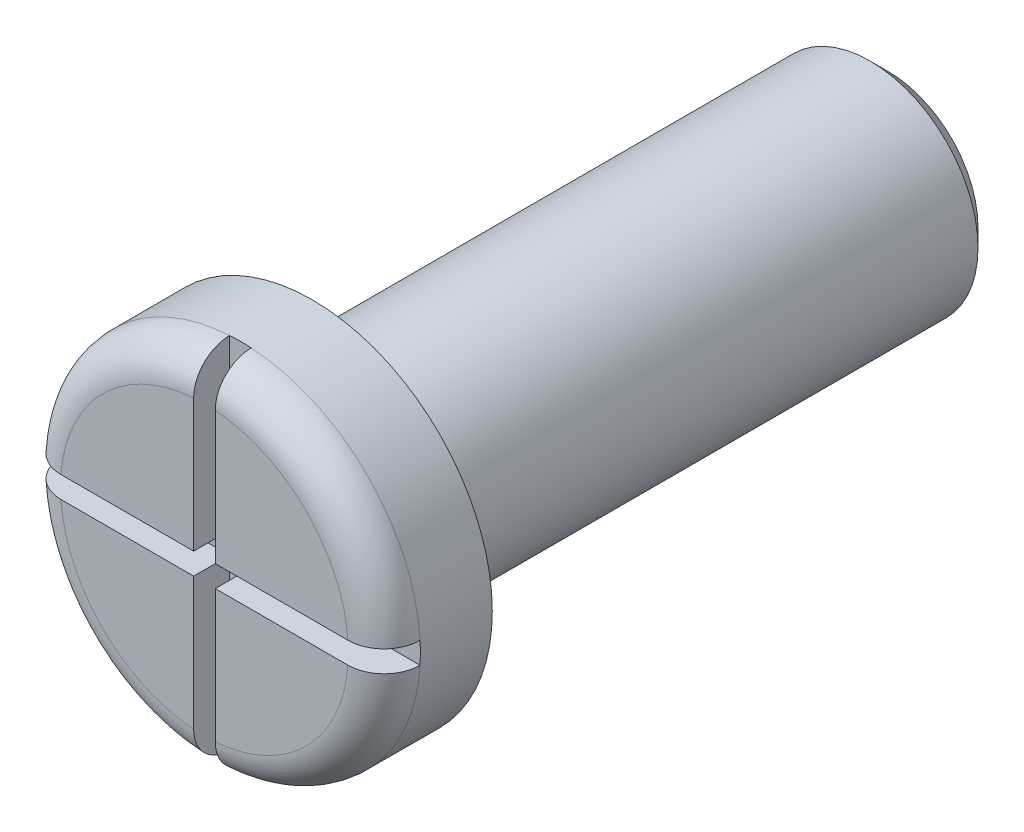
ISO-10303-21;
HEADER;
FILE_DESCRIPTION(('STEP AP214'),'2;1');
FILE_NAME('part.step','',(''),(''),'','','');
FILE_SCHEMA(('AUTOMOTIVE_DESIGN { 1 0 10303 214 1 1 1 1 }'));
ENDSEC;
DATA;
#1=APPLICATION_CONTEXT('core data for automotive mechanical design processes');
#2=APPLICATION_PROTOCOL_DEFINITION('international standard','automotive_design',2000,#1);
#3=PRODUCT_CONTEXT('',#1,'mechanical');
#4=PRODUCT('Part','Part','',(#3));
#5=PRODUCT_RELATED_PRODUCT_CATEGORY('part','',(#4));
#6=PRODUCT_DEFINITION_FORMATION('','',#4);
#7=PRODUCT_DEFINITION_CONTEXT('part definition',#1,'design');
#8=PRODUCT_DEFINITION('design','',#6,#7);
#9=PRODUCT_DEFINITION_SHAPE('','',#8);
#10=(LENGTH_UNIT() NAMED_UNIT(*) SI_UNIT(.MILLI.,.METRE.));
#11=(NAMED_UNIT(*) PLANE_ANGLE_UNIT() SI_UNIT($,.RADIAN.));
#12=(NAMED_UNIT(*) SI_UNIT($,.STERADIAN.) SOLID_ANGLE_UNIT());
#13=UNCERTAINTY_MEASURE_WITH_UNIT(LENGTH_MEASURE(1.E-05),#10,'distance_accuracy_value','');
#14=(GEOMETRIC_REPRESENTATION_CONTEXT(3) GLOBAL_UNCERTAINTY_ASSIGNED_CONTEXT((#13)) GLOBAL_UNIT_ASSIGNED_CONTEXT((#10,
#11,#12)) REPRESENTATION_CONTEXT('',''));
#15=CARTESIAN_POINT('',(0.,0.,0.));
#16=DIRECTION('',(0.,0.,1.));
#17=DIRECTION('',(1.,0.,0.));
#18=AXIS2_PLACEMENT_3D('',#15,#16,#17);
#19=CARTESIAN_POINT('',(0.,0.,0.));
#20=DIRECTION('',(0.,0.,1.));
#21=DIRECTION('',(1.,0.,0.));
#22=AXIS2_PLACEMENT_3D('',#19,#20,#21);
#23=CYLINDRICAL_SURFACE('',#22,2.5);
#24=CARTESIAN_POINT('',(0.,0.,-1.5));
#25=DIRECTION('',(0.,0.,1.));
#26=DIRECTION('',(1.,0.,0.));
#27=AXIS2_PLACEMENT_3D('',#24,#25,#26);
#28=CIRCLE('',#27,2.5);
#29=CARTESIAN_POINT('',(2.5,0.,-1.5));
#30=VERTEX_POINT('',#29);
#31=EDGE_CURVE('E230',#30,#30,#28,.T.);
#32=ORIENTED_EDGE('',*,*,#31,.T.);
#33=EDGE_LOOP('',(#32));
#34=FACE_BOUND('',#33,.T.);
#35=CARTESIAN_POINT('',(0.,0.,-0.5));
#36=DIRECTION('',(0.,0.,1.));
#37=DIRECTION('',(1.,0.,0.));
#38=AXIS2_PLACEMENT_3D('',#35,#36,#37);
#39=CIRCLE('',#38,2.5);
#40=CARTESIAN_POINT('',(-0.149999999999999,-2.49549594269356,-0.5));
#41=VERTEX_POINT('',#40);
#42=CARTESIAN_POINT('',(0.149999999999999,-2.49549594269356,-0.5));
#43=VERTEX_POINT('',#42);
#44=EDGE_CURVE('E135',#41,#43,#39,.T.);
#45=ORIENTED_EDGE('',*,*,#44,.F.);
#46=CARTESIAN_POINT('',(0.,0.,-0.5));
#47=DIRECTION('',(0.,0.,-1.));
#48=DIRECTION('',(-1.,0.,0.));
#49=AXIS2_PLACEMENT_3D('',#46,#47,#48);
#50=CIRCLE('',#49,2.5);
#51=CARTESIAN_POINT('',(-2.49549594269356,-0.15,-0.5));
#52=VERTEX_POINT('',#51);
#53=EDGE_CURVE('E130',#41,#52,#50,.T.);
#54=ORIENTED_EDGE('',*,*,#53,.T.);
#55=CARTESIAN_POINT('',(0.,0.,-0.5));
#56=DIRECTION('',(0.,0.,1.));
#57=DIRECTION('',(1.,0.,0.));
#58=AXIS2_PLACEMENT_3D('',#55,#56,#57);
#59=CIRCLE('',#58,2.5);
#60=CARTESIAN_POINT('',(-2.49549594269356,0.15,-0.5));
#61=VERTEX_POINT('',#60);
#62=EDGE_CURVE('E133',#61,#52,#59,.T.);
#63=ORIENTED_EDGE('',*,*,#62,.F.);
#64=CARTESIAN_POINT('',(0.,0.,-0.5));
#65=DIRECTION('',(0.,0.,-1.));
#66=DIRECTION('',(-1.,0.,0.));
#67=AXIS2_PLACEMENT_3D('',#64,#65,#66);
#68=CIRCLE('',#67,2.5);
#69=CARTESIAN_POINT('',(-0.149999999999999,2.49549594269356,-0.5));
#70=VERTEX_POINT('',#69);
#71=EDGE_CURVE('E241',#61,#70,#68,.T.);
#72=ORIENTED_EDGE('',*,*,#71,.T.);
#73=CARTESIAN_POINT('',(0.,0.,-0.5));
#74=DIRECTION('',(0.,0.,1.));
#75=DIRECTION('',(1.,0.,0.));
#76=AXIS2_PLACEMENT_3D('',#73,#74,#75);
#77=CIRCLE('',#76,2.5);
#78=CARTESIAN_POINT('',(0.149999999999999,2.49549594269356,-0.5));
#79=VERTEX_POINT('',#78);
#80=EDGE_CURVE('E354',#79,#70,#77,.T.);
#81=ORIENTED_EDGE('',*,*,#80,.F.);
#82=CARTESIAN_POINT('',(0.,0.,-0.5));
#83=DIRECTION('',(0.,0.,-1.));
#84=DIRECTION('',(-1.,0.,0.));
#85=AXIS2_PLACEMENT_3D('',#82,#83,#84);
#86=CIRCLE('',#85,2.5);
#87=CARTESIAN_POINT('',(2.49549594269356,0.149999999999999,-0.5));
#88=VERTEX_POINT('',#87);
#89=EDGE_CURVE('E243',#79,#88,#86,.T.);
#90=ORIENTED_EDGE('',*,*,#89,.T.);
#91=CARTESIAN_POINT('',(0.,0.,-0.5));
#92=DIRECTION('',(0.,0.,1.));
#93=DIRECTION('',(1.,0.,0.));
#94=AXIS2_PLACEMENT_3D('',#91,#92,#93);
#95=CIRCLE('',#94,2.5);
#96=CARTESIAN_POINT('',(2.49549594269356,-0.15,-0.5));
#97=VERTEX_POINT('',#96);
#98=EDGE_CURVE('E248',#97,#88,#95,.T.);
#99=ORIENTED_EDGE('',*,*,#98,.F.);
#100=CARTESIAN_POINT('',(0.,0.,-0.5));
#101=DIRECTION('',(0.,0.,-1.));
#102=DIRECTION('',(-1.,0.,0.));
#103=AXIS2_PLACEMENT_3D('',#100,#101,#102);
#104=CIRCLE('',#103,2.5);
#105=EDGE_CURVE('E139',#97,#43,#104,.T.);
#106=ORIENTED_EDGE('',*,*,#105,.T.);
#107=EDGE_LOOP('',(#45,#54,#63,#72,#81,#90,#99,#106));
#108=FACE_BOUND('',#107,.T.);
#109=ADVANCED_FACE('F35',(#34,#108),#23,.T.);
#110=CARTESIAN_POINT('',(0.,2.5,0.));
#111=DIRECTION('',(0.,0.,-1.));
#112=DIRECTION('',(-1.,0.,0.));
#113=AXIS2_PLACEMENT_3D('',#110,#111,#112);
#114=PLANE('',#113);
#115=DIRECTION('',(0.,-1.,0.));
#116=VECTOR('',#115,1.);
#117=CARTESIAN_POINT('',(-0.149999999999999,2.49549594269356,0.));
#118=LINE('',#117,#116);
#119=CARTESIAN_POINT('',(-0.149999999999999,1.99436706751791,0.));
#120=VERTEX_POINT('',#119);
#121=CARTESIAN_POINT('',(-0.149999999999999,0.15,0.));
#122=VERTEX_POINT('',#121);
#123=EDGE_CURVE('E332',#120,#122,#118,.T.);
#124=ORIENTED_EDGE('',*,*,#123,.F.);
#125=CARTESIAN_POINT('',(0.,0.,0.));
#126=DIRECTION('',(0.,0.,-1.));
#127=DIRECTION('',(-1.,0.,0.));
#128=AXIS2_PLACEMENT_3D('',#125,#126,#127);
#129=CIRCLE('',#128,2.);
#130=CARTESIAN_POINT('',(-1.99436706751791,0.15,0.));
#131=VERTEX_POINT('',#130);
#132=EDGE_CURVE('E303',#120,#131,#129,.F.);
#133=ORIENTED_EDGE('',*,*,#132,.T.);
#134=DIRECTION('',(1.,0.,0.));
#135=VECTOR('',#134,1.);
#136=CARTESIAN_POINT('',(-2.49549594269356,0.15,0.));
#137=LINE('',#136,#135);
#138=EDGE_CURVE('E157',#131,#122,#137,.T.);
#139=ORIENTED_EDGE('',*,*,#138,.T.);
#140=EDGE_LOOP('',(#124,#133,#139));
#141=FACE_BOUND('',#140,.T.);
#142=ADVANCED_FACE('F192',(#141),#114,.F.);
#143=DIRECTION('',(1.,0.,0.));
#144=VECTOR('',#143,1.);
#145=CARTESIAN_POINT('',(0.149999999999999,0.15,0.));
#146=LINE('',#145,#144);
#147=CARTESIAN_POINT('',(0.149999999999999,0.15,0.));
#148=VERTEX_POINT('',#147);
#149=CARTESIAN_POINT('',(1.99436706751791,0.15,0.));
#150=VERTEX_POINT('',#149);
#151=EDGE_CURVE('E321',#148,#150,#146,.T.);
#152=ORIENTED_EDGE('',*,*,#151,.T.);
#153=CARTESIAN_POINT('',(0.,0.,0.));
#154=DIRECTION('',(0.,0.,-1.));
#155=DIRECTION('',(-1.,0.,0.));
#156=AXIS2_PLACEMENT_3D('',#153,#154,#155);
#157=CIRCLE('',#156,2.);
#158=CARTESIAN_POINT('',(0.149999999999999,1.99436706751791,0.));
#159=VERTEX_POINT('',#158);
#160=EDGE_CURVE('E266',#150,#159,#157,.F.);
#161=ORIENTED_EDGE('',*,*,#160,.T.);
#162=DIRECTION('',(0.,-1.,0.));
#163=VECTOR('',#162,1.);
#164=CARTESIAN_POINT('',(0.149999999999999,2.49549594269356,0.));
#165=LINE('',#164,#163);
#166=EDGE_CURVE('E325',#159,#148,#165,.T.);
#167=ORIENTED_EDGE('',*,*,#166,.T.);
#168=EDGE_LOOP('',(#152,#161,#167));
#169=FACE_BOUND('',#168,.T.);
#170=ADVANCED_FACE('F387',(#169),#114,.F.);
#171=DIRECTION('',(0.,-1.,0.));
#172=VECTOR('',#171,1.);
#173=CARTESIAN_POINT('',(0.149999999999999,-0.15,0.));
#174=LINE('',#173,#172);
#175=CARTESIAN_POINT('',(0.149999999999999,-0.15,0.));
#176=VERTEX_POINT('',#175);
#177=CARTESIAN_POINT('',(0.149999999999999,-1.99436706751791,0.));
#178=VERTEX_POINT('',#177);
#179=EDGE_CURVE('E322',#176,#178,#174,.T.);
#180=ORIENTED_EDGE('',*,*,#179,.T.);
#181=CARTESIAN_POINT('',(0.,0.,0.));
#182=DIRECTION('',(0.,0.,-1.));
#183=DIRECTION('',(-1.,0.,0.));
#184=AXIS2_PLACEMENT_3D('',#181,#182,#183);
#185=CIRCLE('',#184,2.);
#186=CARTESIAN_POINT('',(1.99436706751791,-0.15,0.));
#187=VERTEX_POINT('',#186);
#188=EDGE_CURVE('E163',#178,#187,#185,.F.);
#189=ORIENTED_EDGE('',*,*,#188,.T.);
#190=DIRECTION('',(1.,0.,0.));
#191=VECTOR('',#190,1.);
#192=CARTESIAN_POINT('',(0.149999999999999,-0.15,0.));
#193=LINE('',#192,#191);
#194=EDGE_CURVE('E319',#176,#187,#193,.T.);
#195=ORIENTED_EDGE('',*,*,#194,.F.);
#196=EDGE_LOOP('',(#180,#189,#195));
#197=FACE_BOUND('',#196,.T.);
#198=ADVANCED_FACE('F193',(#197),#114,.F.);
#199=CARTESIAN_POINT('',(0.,0.,-9.5));
#200=DIRECTION('',(0.,0.,1.));
#201=DIRECTION('',(1.,0.,0.));
#202=AXIS2_PLACEMENT_3D('',#199,#200,#201);
#203=PLANE('',#202);
#204=CARTESIAN_POINT('',(0.,0.,-9.5));
#205=DIRECTION('',(0.,0.,1.));
#206=DIRECTION('',(1.,0.,0.));
#207=AXIS2_PLACEMENT_3D('',#204,#205,#206);
#208=CIRCLE('',#207,1.25);
#209=CARTESIAN_POINT('',(1.25,0.,-9.5));
#210=VERTEX_POINT('',#209);
#211=EDGE_CURVE('E222',#210,#210,#208,.F.);
#212=ORIENTED_EDGE('',*,*,#211,.T.);
#213=EDGE_LOOP('',(#212));
#214=FACE_BOUND('',#213,.T.);
#215=ADVANCED_FACE('F203',(#214),#203,.F.);
#216=CARTESIAN_POINT('',(0.,0.,0.));
#217=DIRECTION('',(0.,0.,1.));
#218=DIRECTION('',(1.,0.,0.));
#219=AXIS2_PLACEMENT_3D('',#216,#217,#218);
#220=CYLINDRICAL_SURFACE('',#219,1.5);
#221=CARTESIAN_POINT('',(0.,0.,-9.25));
#222=DIRECTION('',(0.,0.,1.));
#223=DIRECTION('',(1.,0.,0.));
#224=AXIS2_PLACEMENT_3D('',#221,#222,#223);
#225=CIRCLE('',#224,1.5);
#226=CARTESIAN_POINT('',(1.5,0.,-9.25));
#227=VERTEX_POINT('',#226);
#228=EDGE_CURVE('E225',#227,#227,#225,.T.);
#229=ORIENTED_EDGE('',*,*,#228,.T.);
#230=EDGE_LOOP('',(#229));
#231=FACE_BOUND('',#230,.T.);
#232=CARTESIAN_POINT('',(0.,0.,-1.5));
#233=DIRECTION('',(0.,0.,1.));
#234=DIRECTION('',(1.,0.,0.));
#235=AXIS2_PLACEMENT_3D('',#232,#233,#234);
#236=CIRCLE('',#235,1.5);
#237=CARTESIAN_POINT('',(1.5,0.,-1.5));
#238=VERTEX_POINT('',#237);
#239=EDGE_CURVE('E226',#238,#238,#236,.T.);
#240=ORIENTED_EDGE('',*,*,#239,.F.);
#241=EDGE_LOOP('',(#240));
#242=FACE_BOUND('',#241,.T.);
#243=ADVANCED_FACE('F199',(#231,#242),#220,.T.);
#244=CARTESIAN_POINT('',(0.,1.5,-1.5));
#245=DIRECTION('',(0.,0.,1.));
#246=DIRECTION('',(1.,0.,0.));
#247=AXIS2_PLACEMENT_3D('',#244,#245,#246);
#248=PLANE('',#247);
#249=ORIENTED_EDGE('',*,*,#31,.F.);
#250=EDGE_LOOP('',(#249));
#251=FACE_BOUND('',#250,.T.);
#252=ORIENTED_EDGE('',*,*,#239,.T.);
#253=EDGE_LOOP('',(#252));
#254=FACE_BOUND('',#253,.T.);
#255=ADVANCED_FACE('F190',(#251,#254),#248,.F.);
#256=DIRECTION('',(1.,0.,0.));
#257=VECTOR('',#256,1.);
#258=CARTESIAN_POINT('',(-2.49549594269356,-0.15,0.));
#259=LINE('',#258,#257);
#260=CARTESIAN_POINT('',(-1.99436706751791,-0.15,0.));
#261=VERTEX_POINT('',#260);
#262=CARTESIAN_POINT('',(-0.149999999999999,-0.15,0.));
#263=VERTEX_POINT('',#262);
#264=EDGE_CURVE('E358',#261,#263,#259,.T.);
#265=ORIENTED_EDGE('',*,*,#264,.F.);
#266=CARTESIAN_POINT('',(0.,0.,0.));
#267=DIRECTION('',(0.,0.,-1.));
#268=DIRECTION('',(-1.,0.,0.));
#269=AXIS2_PLACEMENT_3D('',#266,#267,#268);
#270=CIRCLE('',#269,2.);
#271=CARTESIAN_POINT('',(-0.149999999999999,-1.99436706751791,0.));
#272=VERTEX_POINT('',#271);
#273=EDGE_CURVE('E162',#261,#272,#270,.F.);
#274=ORIENTED_EDGE('',*,*,#273,.T.);
#275=DIRECTION('',(0.,-1.,0.));
#276=VECTOR('',#275,1.);
#277=CARTESIAN_POINT('',(-0.149999999999999,-0.15,0.));
#278=LINE('',#277,#276);
#279=EDGE_CURVE('E327',#263,#272,#278,.T.);
#280=ORIENTED_EDGE('',*,*,#279,.F.);
#281=EDGE_LOOP('',(#265,#274,#280));
#282=FACE_BOUND('',#281,.T.);
#283=ADVANCED_FACE('F186',(#282),#114,.F.);
#284=CARTESIAN_POINT('',(0.,0.,-9.25));
#285=DIRECTION('',(0.,0.,1.));
#286=DIRECTION('',(1.,0.,0.));
#287=AXIS2_PLACEMENT_3D('',#284,#285,#286);
#288=CONICAL_SURFACE('',#287,1.5,0.785398163397454);
#289=ORIENTED_EDGE('',*,*,#211,.F.);
#290=EDGE_LOOP('',(#289));
#291=FACE_BOUND('',#290,.T.);
#292=ORIENTED_EDGE('',*,*,#228,.F.);
#293=EDGE_LOOP('',(#292));
#294=FACE_BOUND('',#293,.T.);
#295=ADVANCED_FACE('F189',(#291,#294),#288,.T.);
#296=CARTESIAN_POINT('',(-2.49549594269356,0.15,-0.5));
#297=DIRECTION('',(0.,-1.,0.));
#298=DIRECTION('',(1.,0.,0.));
#299=AXIS2_PLACEMENT_3D('',#296,#297,#298);
#300=PLANE('',#299);
#301=ORIENTED_EDGE('',*,*,#138,.F.);
#302=CARTESIAN_POINT('',(-1.99436706751791,0.15,0.));
#303=CARTESIAN_POINT('',(-2.02261135985479,0.15,2.38348796508798E-05));
#304=CARTESIAN_POINT('',(-2.05084941044357,0.15,-0.00237835778247692));
#305=CARTESIAN_POINT('',(-2.10650897789347,0.15,-0.011863375751998));
#306=CARTESIAN_POINT('',(-2.1339310462392,0.15,-0.018942961119392));
#307=CARTESIAN_POINT('',(-2.18720998344602,0.15,-0.0376167275730258));
#308=CARTESIAN_POINT('',(-2.21306601438598,0.15,-0.0492133012793787));
#309=CARTESIAN_POINT('',(-2.26245495995478,0.15,-0.0765857989762891));
#310=CARTESIAN_POINT('',(-2.28598835434499,0.15,-0.0923608573730415));
#311=CARTESIAN_POINT('',(-2.33002815030781,0.15,-0.12761939294492));
#312=CARTESIAN_POINT('',(-2.35053936248947,0.15,-0.147096861029826));
#313=CARTESIAN_POINT('',(-2.3879963363774,0.15,-0.189230116182782));
#314=CARTESIAN_POINT('',(-2.40494140464404,0.15,-0.211886519972598));
#315=CARTESIAN_POINT('',(-2.43474428362403,0.15,-0.259680301414468));
#316=CARTESIAN_POINT('',(-2.44760999083238,0.15,-0.284812760909784));
#317=CARTESIAN_POINT('',(-2.46892501848137,0.15,-0.336878043175267));
#318=CARTESIAN_POINT('',(-2.47737704837244,0.15,-0.363809749949249));
#319=CARTESIAN_POINT('',(-2.48748872291161,0.15,-0.409093113619825));
#320=CARTESIAN_POINT('',(-2.4904896470431,0.15,-0.427156572636915));
#321=CARTESIAN_POINT('',(-2.49449295074854,0.15,-0.463477461872689));
#322=CARTESIAN_POINT('',(-2.49549817552937,0.15,-0.481734578586009));
#323=CARTESIAN_POINT('',(-2.49549594269356,0.15,-0.5));
#324=B_SPLINE_CURVE_WITH_KNOTS('',3,(#302,#303,#304,#305,#306,#307,#308,#309,#310,#311,#312,
#313,#314,#315,#316,#317,#318,#319,#320,#321,#322,#323),.UNSPECIFIED.,.F.,.F.,(4,2,2,2,2,2,2,2,
2,2,4),(0.,0.0846220365722326,0.169185518455035,0.253793854125785,0.338384676449479,
0.422839360531888,0.50731045175452,0.591617018104123,0.675871769658635,0.730702441530231,
0.785454886712342),.UNSPECIFIED.);
#325=EDGE_CURVE('E49',#131,#61,#324,.T.);
#326=ORIENTED_EDGE('',*,*,#325,.T.);
#327=DIRECTION('',(1.,0.,0.));
#328=VECTOR('',#327,1.);
#329=CARTESIAN_POINT('',(-2.49549594269356,0.15,-0.5));
#330=LINE('',#329,#328);
#331=CARTESIAN_POINT('',(-0.149999999999999,0.15,-0.5));
#332=VERTEX_POINT('',#331);
#333=EDGE_CURVE('E156',#61,#332,#330,.T.);
#334=ORIENTED_EDGE('',*,*,#333,.T.);
#335=DIRECTION('',(0.,0.,1.));
#336=VECTOR('',#335,1.);
#337=CARTESIAN_POINT('',(-0.149999999999999,0.15,-0.5));
#338=LINE('',#337,#336);
#339=EDGE_CURVE('E336',#332,#122,#338,.T.);
#340=ORIENTED_EDGE('',*,*,#339,.T.);
#341=EDGE_LOOP('',(#301,#326,#334,#340));
#342=FACE_BOUND('',#341,.T.);
#343=ADVANCED_FACE('F211',(#342),#300,.T.);
#344=CARTESIAN_POINT('',(-0.149999999999999,2.49549594269356,-0.5));
#345=DIRECTION('',(-1.,0.,0.));
#346=DIRECTION('',(0.,-1.,0.));
#347=AXIS2_PLACEMENT_3D('',#344,#345,#346);
#348=PLANE('',#347);
#349=DIRECTION('',(0.,-1.,0.));
#350=VECTOR('',#349,1.);
#351=CARTESIAN_POINT('',(-0.149999999999999,2.49549594269356,-0.5));
#352=LINE('',#351,#350);
#353=EDGE_CURVE('E351',#70,#332,#352,.T.);
#354=ORIENTED_EDGE('',*,*,#353,.F.);
#355=CARTESIAN_POINT('',(-0.149999999999999,2.49549594269356,-0.5));
#356=CARTESIAN_POINT('',(-0.149999999999999,2.49552000492741,-0.471909874595001));
#357=CARTESIAN_POINT('',(-0.149999999999999,2.49312595356974,-0.443827131320693));
#358=CARTESIAN_POINT('',(-0.149999999999999,2.4836794658758,-0.38847924491216));
#359=CARTESIAN_POINT('',(-0.149999999999999,2.47663089400191,-0.36121344311902));
#360=CARTESIAN_POINT('',(-0.149999999999999,2.45804833986694,-0.308240768196339));
#361=CARTESIAN_POINT('',(-0.149999999999999,2.44651226938785,-0.282534627288388));
#362=CARTESIAN_POINT('',(-0.149999999999999,2.41929452222572,-0.233426017314805));
#363=CARTESIAN_POINT('',(-0.149999999999999,2.40361352517885,-0.210023171444561));
#364=CARTESIAN_POINT('',(-0.149999999999999,2.36853848935991,-0.166162316084215));
#365=CARTESIAN_POINT('',(-0.149999999999999,2.34914192044044,-0.145706330007729));
#366=CARTESIAN_POINT('',(-0.149999999999999,2.30719084874901,-0.108330339068632));
#367=CARTESIAN_POINT('',(-0.149999999999999,2.28463573149479,-0.0914110238507959));
#368=CARTESIAN_POINT('',(-0.149999999999999,2.23696802177625,-0.061558948075416));
#369=CARTESIAN_POINT('',(-0.149999999999999,2.21185059053069,-0.0486339230568003));
#370=CARTESIAN_POINT('',(-0.149999999999999,2.15981016376219,-0.0271798780916368));
#371=CARTESIAN_POINT('',(-0.149999999999999,2.1328881593816,-0.0186484669997172));
#372=CARTESIAN_POINT('',(-0.149999999999999,2.0872345729303,-0.00829858689476623));
#373=CARTESIAN_POINT('',(-0.149999999999999,2.06878536523844,-0.00518823223670625));
#374=CARTESIAN_POINT('',(-0.149999999999999,2.0316822826388,-0.00103918664963963));
#375=CARTESIAN_POINT('',(-0.149999999999999,2.01302873906114,2.46784184290318E-06));
#376=CARTESIAN_POINT('',(-0.149999999999999,1.99436706751791,0.));
#377=B_SPLINE_CURVE_WITH_KNOTS('',3,(#355,#356,#357,#358,#359,#360,#361,#362,#363,#364,#365,
#366,#367,#368,#369,#370,#371,#372,#373,#374,#375,#376),.UNSPECIFIED.,.F.,.F.,(4,2,2,2,2,2,2,2,
2,2,4),(0.,0.0841579148831942,0.168246044516751,0.252373350721498,0.336486871270334,
0.420657874503837,0.504845275659316,0.58919471106068,0.673498192157258,0.729518593703284,
0.785458683918709),.UNSPECIFIED.);
#378=EDGE_CURVE('E11',#70,#120,#377,.T.);
#379=ORIENTED_EDGE('',*,*,#378,.T.);
#380=ORIENTED_EDGE('',*,*,#123,.T.);
#381=ORIENTED_EDGE('',*,*,#339,.F.);
#382=EDGE_LOOP('',(#354,#379,#380,#381));
#383=FACE_BOUND('',#382,.T.);
#384=ADVANCED_FACE('F216',(#383),#348,.F.);
#385=CARTESIAN_POINT('',(0.149999999999999,2.49549594269356,-0.5));
#386=DIRECTION('',(-1.,0.,0.));
#387=DIRECTION('',(0.,0.,1.));
#388=AXIS2_PLACEMENT_3D('',#385,#386,#387);
#389=PLANE('',#388);
#390=ORIENTED_EDGE('',*,*,#166,.F.);
#391=CARTESIAN_POINT('',(0.149999999999999,1.99436706751791,0.));
#392=CARTESIAN_POINT('',(0.149999999999999,2.02261135985479,2.38348796508798E-05));
#393=CARTESIAN_POINT('',(0.149999999999999,2.05084941044357,-0.00237835778247692));
#394=CARTESIAN_POINT('',(0.149999999999999,2.10650897789347,-0.011863375751998));
#395=CARTESIAN_POINT('',(0.149999999999999,2.1339310462392,-0.018942961119392));
#396=CARTESIAN_POINT('',(0.149999999999999,2.18720998344602,-0.0376167275730258));
#397=CARTESIAN_POINT('',(0.149999999999999,2.21306601438598,-0.0492133012793787));
#398=CARTESIAN_POINT('',(0.149999999999999,2.26245495995478,-0.0765857989762891));
#399=CARTESIAN_POINT('',(0.149999999999999,2.28598835434499,-0.0923608573730415));
#400=CARTESIAN_POINT('',(0.149999999999999,2.33002815030781,-0.12761939294492));
#401=CARTESIAN_POINT('',(0.149999999999999,2.35053936248947,-0.147096861029826));
#402=CARTESIAN_POINT('',(0.149999999999999,2.3879963363774,-0.189230116182782));
#403=CARTESIAN_POINT('',(0.149999999999999,2.40494140464404,-0.211886519972598));
#404=CARTESIAN_POINT('',(0.149999999999999,2.43474428362403,-0.259680301414468));
#405=CARTESIAN_POINT('',(0.149999999999999,2.44760999083238,-0.284812760909784));
#406=CARTESIAN_POINT('',(0.149999999999999,2.46892501848137,-0.336878043175267));
#407=CARTESIAN_POINT('',(0.149999999999999,2.47737704837244,-0.363809749949249));
#408=CARTESIAN_POINT('',(0.149999999999999,2.48748872291161,-0.409093113619825));
#409=CARTESIAN_POINT('',(0.149999999999999,2.4904896470431,-0.427156572636915));
#410=CARTESIAN_POINT('',(0.149999999999999,2.49449295074854,-0.463477461872689));
#411=CARTESIAN_POINT('',(0.149999999999999,2.49549817552937,-0.481734578586009));
#412=CARTESIAN_POINT('',(0.149999999999999,2.49549594269356,-0.5));
#413=B_SPLINE_CURVE_WITH_KNOTS('',3,(#391,#392,#393,#394,#395,#396,#397,#398,#399,#400,#401,
#402,#403,#404,#405,#406,#407,#408,#409,#410,#411,#412),.UNSPECIFIED.,.F.,.F.,(4,2,2,2,2,2,2,2,
2,2,4),(0.,0.0846220365722326,0.169185518455035,0.253793854125785,0.338384676449479,
0.422839360531888,0.50731045175452,0.591617018104123,0.675871769658635,0.730702441530231,
0.785454886712342),.UNSPECIFIED.);
#414=EDGE_CURVE('E269',#159,#79,#413,.T.);
#415=ORIENTED_EDGE('',*,*,#414,.T.);
#416=DIRECTION('',(0.,-1.,0.));
#417=VECTOR('',#416,1.);
#418=CARTESIAN_POINT('',(0.149999999999999,2.49549594269356,-0.5));
#419=LINE('',#418,#417);
#420=CARTESIAN_POINT('',(0.149999999999999,0.15,-0.5));
#421=VERTEX_POINT('',#420);
#422=EDGE_CURVE('E366',#79,#421,#419,.T.);
#423=ORIENTED_EDGE('',*,*,#422,.T.);
#424=DIRECTION('',(0.,0.,1.));
#425=VECTOR('',#424,1.);
#426=CARTESIAN_POINT('',(0.149999999999999,0.15,-0.5));
#427=LINE('',#426,#425);
#428=EDGE_CURVE('E339',#421,#148,#427,.T.);
#429=ORIENTED_EDGE('',*,*,#428,.T.);
#430=EDGE_LOOP('',(#390,#415,#423,#429));
#431=FACE_BOUND('',#430,.T.);
#432=ADVANCED_FACE('F308',(#431),#389,.T.);
#433=CARTESIAN_POINT('',(0.149999999999999,0.15,-0.5));
#434=DIRECTION('',(0.,-1.,0.));
#435=DIRECTION('',(1.,0.,0.));
#436=AXIS2_PLACEMENT_3D('',#433,#434,#435);
#437=PLANE('',#436);
#438=DIRECTION('',(1.,0.,0.));
#439=VECTOR('',#438,1.);
#440=CARTESIAN_POINT('',(0.149999999999999,0.15,-0.5));
#441=LINE('',#440,#439);
#442=EDGE_CURVE('E363',#421,#88,#441,.T.);
#443=ORIENTED_EDGE('',*,*,#442,.T.);
#444=CARTESIAN_POINT('',(2.49549594269356,0.149999999999999,-0.5));
#445=CARTESIAN_POINT('',(2.49552000492741,0.15,-0.471909874595001));
#446=CARTESIAN_POINT('',(2.49312595356974,0.15,-0.443827131320693));
#447=CARTESIAN_POINT('',(2.4836794658758,0.15,-0.38847924491216));
#448=CARTESIAN_POINT('',(2.47663089400191,0.15,-0.36121344311902));
#449=CARTESIAN_POINT('',(2.45804833986694,0.15,-0.308240768196339));
#450=CARTESIAN_POINT('',(2.44651226938785,0.15,-0.282534627288388));
#451=CARTESIAN_POINT('',(2.41929452222572,0.15,-0.233426017314804));
#452=CARTESIAN_POINT('',(2.40361352517885,0.15,-0.210023171444561));
#453=CARTESIAN_POINT('',(2.36853848935991,0.15,-0.166162316084215));
#454=CARTESIAN_POINT('',(2.34914192044044,0.15,-0.145706330007729));
#455=CARTESIAN_POINT('',(2.30719084874901,0.15,-0.108330339068632));
#456=CARTESIAN_POINT('',(2.28463573149479,0.15,-0.0914110238507957));
#457=CARTESIAN_POINT('',(2.23696802177625,0.15,-0.0615589480754158));
#458=CARTESIAN_POINT('',(2.21185059053069,0.15,-0.0486339230568001));
#459=CARTESIAN_POINT('',(2.15981016376219,0.15,-0.0271798780916366));
#460=CARTESIAN_POINT('',(2.1328881593816,0.15,-0.0186484669997171));
#461=CARTESIAN_POINT('',(2.0872345729303,0.15,-0.00829858689476617));
#462=CARTESIAN_POINT('',(2.06878536523844,0.15,-0.0051882322367062));
#463=CARTESIAN_POINT('',(2.0316822826388,0.15,-0.0010391866496396));
#464=CARTESIAN_POINT('',(2.01302873906114,0.15,2.46784184293248E-06));
#465=CARTESIAN_POINT('',(1.99436706751791,0.15,0.));
#466=B_SPLINE_CURVE_WITH_KNOTS('',3,(#444,#445,#446,#447,#448,#449,#450,#451,#452,#453,#454,
#455,#456,#457,#458,#459,#460,#461,#462,#463,#464,#465),.UNSPECIFIED.,.F.,.F.,(4,2,2,2,2,2,2,2,
2,2,4),(0.,0.0841579148831943,0.168246044516752,0.252373350721498,0.336486871270334,
0.420657874503837,0.504845275659316,0.58919471106068,0.673498192157258,0.729518593703284,
0.785458683918709),.UNSPECIFIED.);
#467=EDGE_CURVE('E296',#88,#150,#466,.T.);
#468=ORIENTED_EDGE('',*,*,#467,.T.);
#469=ORIENTED_EDGE('',*,*,#151,.F.);
#470=ORIENTED_EDGE('',*,*,#428,.F.);
#471=EDGE_LOOP('',(#443,#468,#469,#470));
#472=FACE_BOUND('',#471,.T.);
#473=ADVANCED_FACE('F304',(#472),#437,.T.);
#474=CARTESIAN_POINT('',(0.149999999999999,-0.15,-0.5));
#475=DIRECTION('',(0.,-1.,0.));
#476=DIRECTION('',(1.,0.,0.));
#477=AXIS2_PLACEMENT_3D('',#474,#475,#476);
#478=PLANE('',#477);
#479=ORIENTED_EDGE('',*,*,#194,.T.);
#480=CARTESIAN_POINT('',(1.99436706751791,-0.15,0.));
#481=CARTESIAN_POINT('',(2.02261135985479,-0.15,2.38348796508798E-05));
#482=CARTESIAN_POINT('',(2.05084941044357,-0.15,-0.00237835778247692));
#483=CARTESIAN_POINT('',(2.10650897789347,-0.15,-0.011863375751998));
#484=CARTESIAN_POINT('',(2.1339310462392,-0.15,-0.018942961119392));
#485=CARTESIAN_POINT('',(2.18720998344602,-0.15,-0.0376167275730258));
#486=CARTESIAN_POINT('',(2.21306601438598,-0.15,-0.0492133012793787));
#487=CARTESIAN_POINT('',(2.26245495995478,-0.15,-0.0765857989762891));
#488=CARTESIAN_POINT('',(2.28598835434499,-0.15,-0.0923608573730415));
#489=CARTESIAN_POINT('',(2.33002815030781,-0.15,-0.12761939294492));
#490=CARTESIAN_POINT('',(2.35053936248947,-0.15,-0.147096861029826));
#491=CARTESIAN_POINT('',(2.3879963363774,-0.15,-0.189230116182782));
#492=CARTESIAN_POINT('',(2.40494140464404,-0.15,-0.211886519972598));
#493=CARTESIAN_POINT('',(2.43474428362403,-0.15,-0.259680301414468));
#494=CARTESIAN_POINT('',(2.44760999083238,-0.15,-0.284812760909784));
#495=CARTESIAN_POINT('',(2.46892501848137,-0.15,-0.336878043175267));
#496=CARTESIAN_POINT('',(2.47737704837244,-0.15,-0.363809749949249));
#497=CARTESIAN_POINT('',(2.48748872291161,-0.15,-0.409093113619825));
#498=CARTESIAN_POINT('',(2.4904896470431,-0.15,-0.427156572636915));
#499=CARTESIAN_POINT('',(2.49449295074854,-0.15,-0.463477461872689));
#500=CARTESIAN_POINT('',(2.49549817552937,-0.15,-0.481734578586009));
#501=CARTESIAN_POINT('',(2.49549594269356,-0.15,-0.5));
#502=B_SPLINE_CURVE_WITH_KNOTS('',3,(#480,#481,#482,#483,#484,#485,#486,#487,#488,#489,#490,
#491,#492,#493,#494,#495,#496,#497,#498,#499,#500,#501),.UNSPECIFIED.,.F.,.F.,(4,2,2,2,2,2,2,2,
2,2,4),(0.,0.0846220365722326,0.169185518455035,0.253793854125785,0.338384676449479,
0.422839360531888,0.50731045175452,0.591617018104123,0.675871769658635,0.730702441530231,
0.785454886712342),.UNSPECIFIED.);
#503=EDGE_CURVE('E166',#187,#97,#502,.T.);
#504=ORIENTED_EDGE('',*,*,#503,.T.);
#505=DIRECTION('',(1.,0.,0.));
#506=VECTOR('',#505,1.);
#507=CARTESIAN_POINT('',(0.149999999999999,-0.15,-0.5));
#508=LINE('',#507,#506);
#509=CARTESIAN_POINT('',(0.149999999999999,-0.15,-0.5));
#510=VERTEX_POINT('',#509);
#511=EDGE_CURVE('E261',#510,#97,#508,.T.);
#512=ORIENTED_EDGE('',*,*,#511,.F.);
#513=DIRECTION('',(0.,0.,1.));
#514=VECTOR('',#513,1.);
#515=CARTESIAN_POINT('',(0.149999999999999,-0.15,-0.5));
#516=LINE('',#515,#514);
#517=EDGE_CURVE('E258',#510,#176,#516,.T.);
#518=ORIENTED_EDGE('',*,*,#517,.T.);
#519=EDGE_LOOP('',(#479,#504,#512,#518));
#520=FACE_BOUND('',#519,.T.);
#521=ADVANCED_FACE('F307',(#520),#478,.F.);
#522=CARTESIAN_POINT('',(0.149999999999999,-0.15,-0.5));
#523=DIRECTION('',(-1.,0.,0.));
#524=DIRECTION('',(0.,-1.,0.));
#525=AXIS2_PLACEMENT_3D('',#522,#523,#524);
#526=PLANE('',#525);
#527=DIRECTION('',(0.,-1.,0.));
#528=VECTOR('',#527,1.);
#529=CARTESIAN_POINT('',(0.149999999999999,-0.15,-0.5));
#530=LINE('',#529,#528);
#531=EDGE_CURVE('E253',#510,#43,#530,.T.);
#532=ORIENTED_EDGE('',*,*,#531,.T.);
#533=CARTESIAN_POINT('',(0.149999999999999,-2.49549594269356,-0.5));
#534=CARTESIAN_POINT('',(0.149999999999999,-2.49552000492741,-0.471909874595001));
#535=CARTESIAN_POINT('',(0.149999999999999,-2.49312595356974,-0.443827131320693));
#536=CARTESIAN_POINT('',(0.149999999999999,-2.4836794658758,-0.38847924491216));
#537=CARTESIAN_POINT('',(0.149999999999999,-2.47663089400191,-0.36121344311902));
#538=CARTESIAN_POINT('',(0.149999999999999,-2.45804833986694,-0.308240768196339));
#539=CARTESIAN_POINT('',(0.149999999999999,-2.44651226938785,-0.282534627288388));
#540=CARTESIAN_POINT('',(0.149999999999999,-2.41929452222572,-0.233426017314805));
#541=CARTESIAN_POINT('',(0.149999999999999,-2.40361352517885,-0.210023171444561));
#542=CARTESIAN_POINT('',(0.149999999999999,-2.36853848935991,-0.166162316084215));
#543=CARTESIAN_POINT('',(0.149999999999999,-2.34914192044044,-0.145706330007729));
#544=CARTESIAN_POINT('',(0.149999999999999,-2.30719084874901,-0.108330339068632));
#545=CARTESIAN_POINT('',(0.149999999999999,-2.28463573149479,-0.0914110238507959));
#546=CARTESIAN_POINT('',(0.149999999999999,-2.23696802177625,-0.061558948075416));
#547=CARTESIAN_POINT('',(0.149999999999999,-2.21185059053069,-0.0486339230568003));
#548=CARTESIAN_POINT('',(0.149999999999999,-2.15981016376219,-0.0271798780916368));
#549=CARTESIAN_POINT('',(0.149999999999999,-2.1328881593816,-0.0186484669997172));
#550=CARTESIAN_POINT('',(0.149999999999999,-2.0872345729303,-0.00829858689476623));
#551=CARTESIAN_POINT('',(0.149999999999999,-2.06878536523844,-0.00518823223670625));
#552=CARTESIAN_POINT('',(0.149999999999999,-2.0316822826388,-0.00103918664963963));
#553=CARTESIAN_POINT('',(0.149999999999999,-2.01302873906114,2.46784184290318E-06));
#554=CARTESIAN_POINT('',(0.149999999999999,-1.99436706751791,0.));
#555=B_SPLINE_CURVE_WITH_KNOTS('',3,(#533,#534,#535,#536,#537,#538,#539,#540,#541,#542,#543,
#544,#545,#546,#547,#548,#549,#550,#551,#552,#553,#554),.UNSPECIFIED.,.F.,.F.,(4,2,2,2,2,2,2,2,
2,2,4),(0.,0.0841579148831942,0.168246044516751,0.252373350721498,0.336486871270334,
0.420657874503837,0.504845275659316,0.58919471106068,0.673498192157258,0.729518593703284,
0.785458683918709),.UNSPECIFIED.);
#556=EDGE_CURVE('E256',#43,#178,#555,.T.);
#557=ORIENTED_EDGE('',*,*,#556,.T.);
#558=ORIENTED_EDGE('',*,*,#179,.F.);
#559=ORIENTED_EDGE('',*,*,#517,.F.);
#560=EDGE_LOOP('',(#532,#557,#558,#559));
#561=FACE_BOUND('',#560,.T.);
#562=ADVANCED_FACE('F254',(#561),#526,.T.);
#563=CARTESIAN_POINT('',(-0.149999999999999,-0.15,-0.5));
#564=DIRECTION('',(-1.,0.,0.));
#565=DIRECTION('',(0.,-1.,0.));
#566=AXIS2_PLACEMENT_3D('',#563,#564,#565);
#567=PLANE('',#566);
#568=ORIENTED_EDGE('',*,*,#279,.T.);
#569=CARTESIAN_POINT('',(-0.149999999999999,-1.99436706751791,0.));
#570=CARTESIAN_POINT('',(-0.149999999999999,-2.02261135985479,2.38348796508798E-05));
#571=CARTESIAN_POINT('',(-0.149999999999999,-2.05084941044357,-0.00237835778247692));
#572=CARTESIAN_POINT('',(-0.149999999999999,-2.10650897789347,-0.011863375751998));
#573=CARTESIAN_POINT('',(-0.149999999999999,-2.1339310462392,-0.018942961119392));
#574=CARTESIAN_POINT('',(-0.149999999999999,-2.18720998344602,-0.0376167275730258));
#575=CARTESIAN_POINT('',(-0.149999999999999,-2.21306601438598,-0.0492133012793787));
#576=CARTESIAN_POINT('',(-0.149999999999999,-2.26245495995478,-0.0765857989762891));
#577=CARTESIAN_POINT('',(-0.149999999999999,-2.28598835434499,-0.0923608573730415));
#578=CARTESIAN_POINT('',(-0.149999999999999,-2.33002815030781,-0.12761939294492));
#579=CARTESIAN_POINT('',(-0.149999999999999,-2.35053936248947,-0.147096861029826));
#580=CARTESIAN_POINT('',(-0.149999999999999,-2.3879963363774,-0.189230116182782));
#581=CARTESIAN_POINT('',(-0.149999999999999,-2.40494140464404,-0.211886519972598));
#582=CARTESIAN_POINT('',(-0.149999999999999,-2.43474428362403,-0.259680301414468));
#583=CARTESIAN_POINT('',(-0.149999999999999,-2.44760999083238,-0.284812760909784));
#584=CARTESIAN_POINT('',(-0.149999999999999,-2.46892501848137,-0.336878043175267));
#585=CARTESIAN_POINT('',(-0.149999999999999,-2.47737704837244,-0.363809749949249));
#586=CARTESIAN_POINT('',(-0.149999999999999,-2.48748872291161,-0.409093113619825));
#587=CARTESIAN_POINT('',(-0.149999999999999,-2.4904896470431,-0.427156572636915));
#588=CARTESIAN_POINT('',(-0.149999999999999,-2.49449295074854,-0.463477461872689));
#589=CARTESIAN_POINT('',(-0.149999999999999,-2.49549817552937,-0.481734578586009));
#590=CARTESIAN_POINT('',(-0.149999999999999,-2.49549594269356,-0.5));
#591=B_SPLINE_CURVE_WITH_KNOTS('',3,(#569,#570,#571,#572,#573,#574,#575,#576,#577,#578,#579,
#580,#581,#582,#583,#584,#585,#586,#587,#588,#589,#590),.UNSPECIFIED.,.F.,.F.,(4,2,2,2,2,2,2,2,
2,2,4),(0.,0.0846220365722326,0.169185518455035,0.253793854125785,0.338384676449479,
0.422839360531888,0.50731045175452,0.591617018104123,0.675871769658635,0.730702441530231,
0.785454886712342),.UNSPECIFIED.);
#592=EDGE_CURVE('E235',#272,#41,#591,.T.);
#593=ORIENTED_EDGE('',*,*,#592,.T.);
#594=DIRECTION('',(0.,-1.,0.));
#595=VECTOR('',#594,1.);
#596=CARTESIAN_POINT('',(-0.149999999999999,-0.15,-0.5));
#597=LINE('',#596,#595);
#598=CARTESIAN_POINT('',(-0.149999999999999,-0.15,-0.5));
#599=VERTEX_POINT('',#598);
#600=EDGE_CURVE('E151',#599,#41,#597,.T.);
#601=ORIENTED_EDGE('',*,*,#600,.F.);
#602=DIRECTION('',(0.,0.,1.));
#603=VECTOR('',#602,1.);
#604=CARTESIAN_POINT('',(-0.149999999999999,-0.15,-0.5));
#605=LINE('',#604,#603);
#606=EDGE_CURVE('E147',#599,#263,#605,.T.);
#607=ORIENTED_EDGE('',*,*,#606,.T.);
#608=EDGE_LOOP('',(#568,#593,#601,#607));
#609=FACE_BOUND('',#608,.T.);
#610=ADVANCED_FACE('F183',(#609),#567,.F.);
#611=CARTESIAN_POINT('',(-2.49549594269356,-0.15,-0.5));
#612=DIRECTION('',(0.,-1.,0.));
#613=DIRECTION('',(1.,0.,0.));
#614=AXIS2_PLACEMENT_3D('',#611,#612,#613);
#615=PLANE('',#614);
#616=DIRECTION('',(1.,0.,0.));
#617=VECTOR('',#616,1.);
#618=CARTESIAN_POINT('',(-2.49549594269356,-0.15,-0.5));
#619=LINE('',#618,#617);
#620=EDGE_CURVE('E143',#52,#599,#619,.T.);
#621=ORIENTED_EDGE('',*,*,#620,.F.);
#622=CARTESIAN_POINT('',(-2.49549594269356,-0.15,-0.5));
#623=CARTESIAN_POINT('',(-2.49552000492741,-0.15,-0.471909874595001));
#624=CARTESIAN_POINT('',(-2.49312595356974,-0.15,-0.443827131320693));
#625=CARTESIAN_POINT('',(-2.4836794658758,-0.15,-0.38847924491216));
#626=CARTESIAN_POINT('',(-2.47663089400191,-0.15,-0.36121344311902));
#627=CARTESIAN_POINT('',(-2.45804833986694,-0.15,-0.308240768196339));
#628=CARTESIAN_POINT('',(-2.44651226938785,-0.15,-0.282534627288388));
#629=CARTESIAN_POINT('',(-2.41929452222572,-0.15,-0.233426017314804));
#630=CARTESIAN_POINT('',(-2.40361352517885,-0.15,-0.210023171444561));
#631=CARTESIAN_POINT('',(-2.36853848935991,-0.15,-0.166162316084215));
#632=CARTESIAN_POINT('',(-2.34914192044044,-0.15,-0.145706330007729));
#633=CARTESIAN_POINT('',(-2.30719084874901,-0.15,-0.108330339068632));
#634=CARTESIAN_POINT('',(-2.28463573149479,-0.15,-0.0914110238507957));
#635=CARTESIAN_POINT('',(-2.23696802177625,-0.15,-0.0615589480754158));
#636=CARTESIAN_POINT('',(-2.21185059053069,-0.15,-0.0486339230568001));
#637=CARTESIAN_POINT('',(-2.15981016376219,-0.15,-0.0271798780916366));
#638=CARTESIAN_POINT('',(-2.1328881593816,-0.15,-0.0186484669997171));
#639=CARTESIAN_POINT('',(-2.0872345729303,-0.15,-0.00829858689476617));
#640=CARTESIAN_POINT('',(-2.06878536523844,-0.15,-0.0051882322367062));
#641=CARTESIAN_POINT('',(-2.0316822826388,-0.15,-0.0010391866496396));
#642=CARTESIAN_POINT('',(-2.01302873906114,-0.15,2.46784184293248E-06));
#643=CARTESIAN_POINT('',(-1.99436706751791,-0.15,0.));
#644=B_SPLINE_CURVE_WITH_KNOTS('',3,(#622,#623,#624,#625,#626,#627,#628,#629,#630,#631,#632,
#633,#634,#635,#636,#637,#638,#639,#640,#641,#642,#643),.UNSPECIFIED.,.F.,.F.,(4,2,2,2,2,2,2,2,
2,2,4),(0.,0.0841579148831943,0.168246044516752,0.252373350721498,0.336486871270334,
0.420657874503837,0.504845275659316,0.58919471106068,0.673498192157258,0.729518593703284,
0.785458683918709),.UNSPECIFIED.);
#645=EDGE_CURVE('E138',#52,#261,#644,.T.);
#646=ORIENTED_EDGE('',*,*,#645,.T.);
#647=ORIENTED_EDGE('',*,*,#264,.T.);
#648=ORIENTED_EDGE('',*,*,#606,.F.);
#649=EDGE_LOOP('',(#621,#646,#647,#648));
#650=FACE_BOUND('',#649,.T.);
#651=ADVANCED_FACE('F144',(#650),#615,.F.);
#652=CARTESIAN_POINT('',(0.,0.,-0.5));
#653=DIRECTION('',(0.,0.,1.));
#654=DIRECTION('',(1.,0.,0.));
#655=AXIS2_PLACEMENT_3D('',#652,#653,#654);
#656=PLANE('',#655);
#657=ORIENTED_EDGE('',*,*,#62,.T.);
#658=ORIENTED_EDGE('',*,*,#620,.T.);
#659=ORIENTED_EDGE('',*,*,#600,.T.);
#660=ORIENTED_EDGE('',*,*,#44,.T.);
#661=ORIENTED_EDGE('',*,*,#531,.F.);
#662=ORIENTED_EDGE('',*,*,#511,.T.);
#663=ORIENTED_EDGE('',*,*,#98,.T.);
#664=ORIENTED_EDGE('',*,*,#442,.F.);
#665=ORIENTED_EDGE('',*,*,#422,.F.);
#666=ORIENTED_EDGE('',*,*,#80,.T.);
#667=ORIENTED_EDGE('',*,*,#353,.T.);
#668=ORIENTED_EDGE('',*,*,#333,.F.);
#669=EDGE_LOOP('',(#657,#658,#659,#660,#661,#662,#663,#664,#665,#666,#667,#668));
#670=FACE_BOUND('',#669,.T.);
#671=ADVANCED_FACE('F154',(#670),#656,.T.);
#672=CARTESIAN_POINT('',(0.,0.,-0.5));
#673=DIRECTION('',(0.,0.,-1.));
#674=DIRECTION('',(-1.,0.,0.));
#675=AXIS2_PLACEMENT_3D('',#672,#673,#674);
#676=TOROIDAL_SURFACE('',#675,2.,0.5);
#677=ORIENTED_EDGE('',*,*,#645,.F.);
#678=ORIENTED_EDGE('',*,*,#53,.F.);
#679=ORIENTED_EDGE('',*,*,#592,.F.);
#680=ORIENTED_EDGE('',*,*,#273,.F.);
#681=EDGE_LOOP('',(#677,#678,#679,#680));
#682=FACE_BOUND('',#681,.T.);
#683=ADVANCED_FACE('F160',(#682),#676,.T.);
#684=CARTESIAN_POINT('',(0.,0.,-0.5));
#685=DIRECTION('',(0.,0.,-1.));
#686=DIRECTION('',(-1.,0.,0.));
#687=AXIS2_PLACEMENT_3D('',#684,#685,#686);
#688=TOROIDAL_SURFACE('',#687,2.,0.5);
#689=ORIENTED_EDGE('',*,*,#556,.F.);
#690=ORIENTED_EDGE('',*,*,#105,.F.);
#691=ORIENTED_EDGE('',*,*,#503,.F.);
#692=ORIENTED_EDGE('',*,*,#188,.F.);
#693=EDGE_LOOP('',(#689,#690,#691,#692));
#694=FACE_BOUND('',#693,.T.);
#695=ADVANCED_FACE('F265',(#694),#688,.T.);
#696=CARTESIAN_POINT('',(0.,0.,-0.5));
#697=DIRECTION('',(0.,0.,-1.));
#698=DIRECTION('',(-1.,0.,0.));
#699=AXIS2_PLACEMENT_3D('',#696,#697,#698);
#700=TOROIDAL_SURFACE('',#699,2.,0.5);
#701=ORIENTED_EDGE('',*,*,#467,.F.);
#702=ORIENTED_EDGE('',*,*,#89,.F.);
#703=ORIENTED_EDGE('',*,*,#414,.F.);
#704=ORIENTED_EDGE('',*,*,#160,.F.);
#705=EDGE_LOOP('',(#701,#702,#703,#704));
#706=FACE_BOUND('',#705,.T.);
#707=ADVANCED_FACE('F284',(#706),#700,.T.);
#708=CARTESIAN_POINT('',(0.,0.,-0.5));
#709=DIRECTION('',(0.,0.,-1.));
#710=DIRECTION('',(-1.,0.,0.));
#711=AXIS2_PLACEMENT_3D('',#708,#709,#710);
#712=TOROIDAL_SURFACE('',#711,2.,0.5);
#713=ORIENTED_EDGE('',*,*,#378,.F.);
#714=ORIENTED_EDGE('',*,*,#71,.F.);
#715=ORIENTED_EDGE('',*,*,#325,.F.);
#716=ORIENTED_EDGE('',*,*,#132,.F.);
#717=EDGE_LOOP('',(#713,#714,#715,#716));
#718=FACE_BOUND('',#717,.T.);
#719=ADVANCED_FACE('F37',(#718),#712,.T.);
#720=CLOSED_SHELL('',(#109,#142,#170,#198,#215,#243,#255,#283,#295,#343,#384,#432,#473,#521,
#562,#610,#651,#671,#683,#695,#707,#719));
#721=MANIFOLD_SOLID_BREP('B2',#720);
#722=ADVANCED_BREP_SHAPE_REPRESENTATION('',(#18,#721),#14);
#723=SHAPE_DEFINITION_REPRESENTATION(#9,#722);
ENDSEC;
END-ISO-10303-21;
